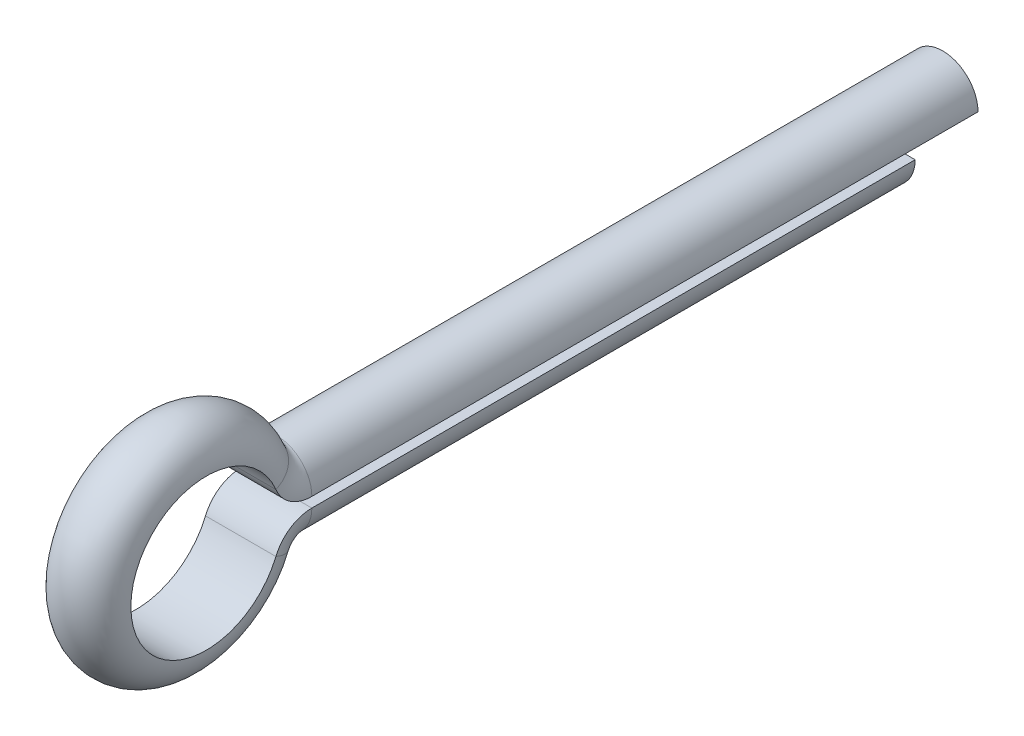
ISO-10303-21;
HEADER;
FILE_DESCRIPTION(('STEP AP214'),'2;1');
FILE_NAME('part.step','',(''),(''),'','','');
FILE_SCHEMA(('AUTOMOTIVE_DESIGN { 1 0 10303 214 1 1 1 1 }'));
ENDSEC;
DATA;
#1=APPLICATION_CONTEXT('core data for automotive mechanical design processes');
#2=APPLICATION_PROTOCOL_DEFINITION('international standard','automotive_design',2000,#1);
#3=PRODUCT_CONTEXT('',#1,'mechanical');
#4=PRODUCT('Part','Part','',(#3));
#5=PRODUCT_RELATED_PRODUCT_CATEGORY('part','',(#4));
#6=PRODUCT_DEFINITION_FORMATION('','',#4);
#7=PRODUCT_DEFINITION_CONTEXT('part definition',#1,'design');
#8=PRODUCT_DEFINITION('design','',#6,#7);
#9=PRODUCT_DEFINITION_SHAPE('','',#8);
#10=(LENGTH_UNIT() NAMED_UNIT(*) SI_UNIT(.MILLI.,.METRE.));
#11=(NAMED_UNIT(*) PLANE_ANGLE_UNIT() SI_UNIT($,.RADIAN.));
#12=(NAMED_UNIT(*) SI_UNIT($,.STERADIAN.) SOLID_ANGLE_UNIT());
#13=UNCERTAINTY_MEASURE_WITH_UNIT(LENGTH_MEASURE(1.E-05),#10,'distance_accuracy_value','');
#14=(GEOMETRIC_REPRESENTATION_CONTEXT(3) GLOBAL_UNCERTAINTY_ASSIGNED_CONTEXT((#13)) GLOBAL_UNIT_ASSIGNED_CONTEXT((#10,
#11,#12)) REPRESENTATION_CONTEXT('',''));
#15=CARTESIAN_POINT('',(0.,0.,0.));
#16=DIRECTION('',(0.,0.,1.));
#17=DIRECTION('',(1.,0.,0.));
#18=AXIS2_PLACEMENT_3D('',#15,#16,#17);
#19=CARTESIAN_POINT('',(0.,-0.1,0.));
#20=DIRECTION('',(0.,0.,1.));
#21=DIRECTION('',(1.,0.,0.));
#22=AXIS2_PLACEMENT_3D('',#19,#20,#21);
#23=PLANE('',#22);
#24=CARTESIAN_POINT('',(0.,-0.1,0.));
#25=DIRECTION('',(0.,0.,1.));
#26=DIRECTION('',(1.,0.,0.));
#27=AXIS2_PLACEMENT_3D('',#24,#25,#26);
#28=CIRCLE('',#27,0.7);
#29=CARTESIAN_POINT('',(-0.7,-0.1,0.));
#30=VERTEX_POINT('',#29);
#31=CARTESIAN_POINT('',(0.7,-0.1,0.));
#32=VERTEX_POINT('',#31);
#33=EDGE_CURVE('E46',#30,#32,#28,.T.);
#34=ORIENTED_EDGE('',*,*,#33,.F.);
#35=DIRECTION('',(-1.,0.,0.));
#36=VECTOR('',#35,1.);
#37=CARTESIAN_POINT('',(-0.7,-0.1,0.));
#38=LINE('',#37,#36);
#39=EDGE_CURVE('E11',#32,#30,#38,.T.);
#40=ORIENTED_EDGE('',*,*,#39,.F.);
#41=EDGE_LOOP('',(#34,#40));
#42=FACE_BOUND('',#41,.T.);
#43=ADVANCED_FACE('F32',(#42),#23,.F.);
#44=CARTESIAN_POINT('',(0.,0.,14.1));
#45=DIRECTION('',(1.,0.,0.));
#46=DIRECTION('',(0.,0.,-1.));
#47=AXIS2_PLACEMENT_3D('',#44,#45,#46);
#48=TOROIDAL_SURFACE('',#47,1.5,0.7);
#49=CARTESIAN_POINT('',(0.7,0.,14.1));
#50=DIRECTION('',(1.,0.,0.));
#51=DIRECTION('',(0.,0.,1.));
#52=AXIS2_PLACEMENT_3D('',#49,#50,#51);
#53=CIRCLE('',#52,1.5);
#54=CARTESIAN_POINT('',(0.7,0.576923076923077,12.7153846153846));
#55=VERTEX_POINT('',#54);
#56=CARTESIAN_POINT('',(0.7,-0.576923076923077,12.7153846153846));
#57=VERTEX_POINT('',#56);
#58=EDGE_CURVE('E122',#55,#57,#53,.T.);
#59=ORIENTED_EDGE('',*,*,#58,.F.);
#60=CARTESIAN_POINT('',(0.,0.576923076923078,12.7153846153846));
#61=DIRECTION('',(0.,-0.923076923076923,-0.384615384615384));
#62=DIRECTION('',(1.,0.,0.));
#63=AXIS2_PLACEMENT_3D('',#60,#61,#62);
#64=CIRCLE('',#63,0.7);
#65=CARTESIAN_POINT('',(-0.7,0.576923076923077,12.7153846153846));
#66=VERTEX_POINT('',#65);
#67=EDGE_CURVE('E100',#55,#66,#64,.F.);
#68=ORIENTED_EDGE('',*,*,#67,.T.);
#69=CARTESIAN_POINT('',(-0.7,0.,14.1));
#70=DIRECTION('',(1.,0.,0.));
#71=DIRECTION('',(0.,0.,1.));
#72=AXIS2_PLACEMENT_3D('',#69,#70,#71);
#73=CIRCLE('',#72,1.5);
#74=CARTESIAN_POINT('',(-0.7,-0.576923076923077,12.7153846153846));
#75=VERTEX_POINT('',#74);
#76=EDGE_CURVE('E114',#66,#75,#73,.T.);
#77=ORIENTED_EDGE('',*,*,#76,.T.);
#78=CARTESIAN_POINT('',(0.,-0.576923076923078,12.7153846153846));
#79=DIRECTION('',(0.,-0.923076923076923,0.384615384615384));
#80=DIRECTION('',(1.,0.,0.));
#81=AXIS2_PLACEMENT_3D('',#78,#79,#80);
#82=CIRCLE('',#81,0.7);
#83=EDGE_CURVE('E119',#75,#57,#82,.T.);
#84=ORIENTED_EDGE('',*,*,#83,.T.);
#85=EDGE_LOOP('',(#59,#68,#77,#84));
#86=FACE_BOUND('',#85,.T.);
#87=ADVANCED_FACE('F154',(#86),#48,.T.);
#88=CARTESIAN_POINT('',(0.,0.,14.1));
#89=DIRECTION('',(1.,0.,0.));
#90=DIRECTION('',(0.,0.,-1.));
#91=AXIS2_PLACEMENT_3D('',#88,#89,#90);
#92=CYLINDRICAL_SURFACE('',#91,1.5);
#93=DIRECTION('',(-1.,0.,0.));
#94=VECTOR('',#93,1.);
#95=CARTESIAN_POINT('',(-0.7,-0.576923076923078,12.7153846153846));
#96=LINE('',#95,#94);
#97=EDGE_CURVE('E125',#57,#75,#96,.T.);
#98=ORIENTED_EDGE('',*,*,#97,.T.);
#99=ORIENTED_EDGE('',*,*,#76,.F.);
#100=DIRECTION('',(-1.,0.,0.));
#101=VECTOR('',#100,1.);
#102=CARTESIAN_POINT('',(-0.7,0.576923076923078,12.7153846153846));
#103=LINE('',#102,#101);
#104=EDGE_CURVE('E107',#66,#55,#103,.F.);
#105=ORIENTED_EDGE('',*,*,#104,.T.);
#106=ORIENTED_EDGE('',*,*,#58,.T.);
#107=EDGE_LOOP('',(#98,#99,#105,#106));
#108=FACE_BOUND('',#107,.T.);
#109=ADVANCED_FACE('F158',(#108),#92,.F.);
#110=CARTESIAN_POINT('',(0.,-0.875,12.));
#111=DIRECTION('',(-1.,0.,0.));
#112=DIRECTION('',(0.,0.,1.));
#113=AXIS2_PLACEMENT_3D('',#110,#111,#112);
#114=TOROIDAL_SURFACE('',#113,0.775,0.7);
#115=CARTESIAN_POINT('',(0.7,-0.875,12.));
#116=DIRECTION('',(-1.,0.,0.));
#117=DIRECTION('',(0.,0.384615384615383,0.923076923076924));
#118=AXIS2_PLACEMENT_3D('',#115,#116,#117);
#119=CIRCLE('',#118,0.775);
#120=CARTESIAN_POINT('',(0.7,-0.1,12.));
#121=VERTEX_POINT('',#120);
#122=EDGE_CURVE('E131',#57,#121,#119,.T.);
#123=ORIENTED_EDGE('',*,*,#122,.F.);
#124=ORIENTED_EDGE('',*,*,#83,.F.);
#125=CARTESIAN_POINT('',(-0.7,-0.875,12.));
#126=DIRECTION('',(-1.,0.,0.));
#127=DIRECTION('',(0.,0.384615384615383,0.923076923076924));
#128=AXIS2_PLACEMENT_3D('',#125,#126,#127);
#129=CIRCLE('',#128,0.775);
#130=CARTESIAN_POINT('',(-0.7,-0.1,12.));
#131=VERTEX_POINT('',#130);
#132=EDGE_CURVE('E132',#75,#131,#129,.T.);
#133=ORIENTED_EDGE('',*,*,#132,.T.);
#134=CARTESIAN_POINT('',(0.,-0.100000000000001,12.));
#135=DIRECTION('',(0.,0.,1.));
#136=DIRECTION('',(1.,0.,0.));
#137=AXIS2_PLACEMENT_3D('',#134,#135,#136);
#138=CIRCLE('',#137,0.7);
#139=EDGE_CURVE('E128',#131,#121,#138,.T.);
#140=ORIENTED_EDGE('',*,*,#139,.T.);
#141=EDGE_LOOP('',(#123,#124,#133,#140));
#142=FACE_BOUND('',#141,.T.);
#143=ADVANCED_FACE('F152',(#142),#114,.T.);
#144=CARTESIAN_POINT('',(0.,-0.875,12.));
#145=DIRECTION('',(-1.,0.,0.));
#146=DIRECTION('',(0.,0.,1.));
#147=AXIS2_PLACEMENT_3D('',#144,#145,#146);
#148=CYLINDRICAL_SURFACE('',#147,0.775);
#149=DIRECTION('',(-1.,0.,0.));
#150=VECTOR('',#149,1.);
#151=CARTESIAN_POINT('',(-0.7,-0.100000000000001,12.));
#152=LINE('',#151,#150);
#153=EDGE_CURVE('E135',#121,#131,#152,.T.);
#154=ORIENTED_EDGE('',*,*,#153,.T.);
#155=ORIENTED_EDGE('',*,*,#132,.F.);
#156=ORIENTED_EDGE('',*,*,#97,.F.);
#157=ORIENTED_EDGE('',*,*,#122,.T.);
#158=EDGE_LOOP('',(#154,#155,#156,#157));
#159=FACE_BOUND('',#158,.T.);
#160=ADVANCED_FACE('F147',(#159),#148,.T.);
#161=CARTESIAN_POINT('',(0.,-0.100000000000002,12.));
#162=DIRECTION('',(0.,0.,-1.));
#163=DIRECTION('',(0.,1.,0.));
#164=AXIS2_PLACEMENT_3D('',#161,#162,#163);
#165=CYLINDRICAL_SURFACE('',#164,0.7);
#166=DIRECTION('',(0.,0.,-1.));
#167=VECTOR('',#166,1.);
#168=CARTESIAN_POINT('',(0.7,-0.100000000000001,12.));
#169=LINE('',#168,#167);
#170=EDGE_CURVE('E39',#121,#32,#169,.T.);
#171=ORIENTED_EDGE('',*,*,#170,.F.);
#172=ORIENTED_EDGE('',*,*,#139,.F.);
#173=DIRECTION('',(0.,0.,-1.));
#174=VECTOR('',#173,1.);
#175=CARTESIAN_POINT('',(-0.7,-0.100000000000001,12.));
#176=LINE('',#175,#174);
#177=EDGE_CURVE('E139',#131,#30,#176,.T.);
#178=ORIENTED_EDGE('',*,*,#177,.T.);
#179=ORIENTED_EDGE('',*,*,#33,.T.);
#180=EDGE_LOOP('',(#171,#172,#178,#179));
#181=FACE_BOUND('',#180,.T.);
#182=ADVANCED_FACE('F149',(#181),#165,.T.);
#183=CARTESIAN_POINT('',(-0.7,-0.100000000000001,12.));
#184=DIRECTION('',(0.,-1.,0.));
#185=DIRECTION('',(0.,0.,-1.));
#186=AXIS2_PLACEMENT_3D('',#183,#184,#185);
#187=PLANE('',#186);
#188=ORIENTED_EDGE('',*,*,#39,.T.);
#189=ORIENTED_EDGE('',*,*,#177,.F.);
#190=ORIENTED_EDGE('',*,*,#153,.F.);
#191=ORIENTED_EDGE('',*,*,#170,.T.);
#192=EDGE_LOOP('',(#188,#189,#190,#191));
#193=FACE_BOUND('',#192,.T.);
#194=ADVANCED_FACE('F172',(#193),#187,.F.);
#195=CARTESIAN_POINT('',(0.,0.875,12.));
#196=DIRECTION('',(1.,0.,0.));
#197=DIRECTION('',(0.,0.,-1.));
#198=AXIS2_PLACEMENT_3D('',#195,#196,#197);
#199=TOROIDAL_SURFACE('',#198,0.775,0.7);
#200=CARTESIAN_POINT('',(-0.7,0.875,12.));
#201=DIRECTION('',(1.,0.,0.));
#202=DIRECTION('',(0.,-0.384615384615383,0.923076923076924));
#203=AXIS2_PLACEMENT_3D('',#200,#201,#202);
#204=CIRCLE('',#203,0.775);
#205=CARTESIAN_POINT('',(-0.7,0.1,12.));
#206=VERTEX_POINT('',#205);
#207=EDGE_CURVE('E109',#66,#206,#204,.T.);
#208=ORIENTED_EDGE('',*,*,#207,.F.);
#209=ORIENTED_EDGE('',*,*,#67,.F.);
#210=CARTESIAN_POINT('',(0.7,0.875,12.));
#211=DIRECTION('',(1.,0.,0.));
#212=DIRECTION('',(0.,-0.384615384615383,0.923076923076924));
#213=AXIS2_PLACEMENT_3D('',#210,#211,#212);
#214=CIRCLE('',#213,0.775);
#215=CARTESIAN_POINT('',(0.7,0.1,12.));
#216=VERTEX_POINT('',#215);
#217=EDGE_CURVE('E110',#55,#216,#214,.T.);
#218=ORIENTED_EDGE('',*,*,#217,.T.);
#219=CARTESIAN_POINT('',(0.,0.100000000000001,12.));
#220=DIRECTION('',(0.,0.,-1.));
#221=DIRECTION('',(1.,0.,0.));
#222=AXIS2_PLACEMENT_3D('',#219,#220,#221);
#223=CIRCLE('',#222,0.7);
#224=EDGE_CURVE('E88',#216,#206,#223,.F.);
#225=ORIENTED_EDGE('',*,*,#224,.T.);
#226=EDGE_LOOP('',(#208,#209,#218,#225));
#227=FACE_BOUND('',#226,.T.);
#228=ADVANCED_FACE('F161',(#227),#199,.T.);
#229=CARTESIAN_POINT('',(0.,0.875,12.));
#230=DIRECTION('',(1.,0.,0.));
#231=DIRECTION('',(0.,0.,-1.));
#232=AXIS2_PLACEMENT_3D('',#229,#230,#231);
#233=CYLINDRICAL_SURFACE('',#232,0.775);
#234=DIRECTION('',(-1.,0.,0.));
#235=VECTOR('',#234,1.);
#236=CARTESIAN_POINT('',(-0.7,0.100000000000001,12.));
#237=LINE('',#236,#235);
#238=EDGE_CURVE('E94',#206,#216,#237,.F.);
#239=ORIENTED_EDGE('',*,*,#238,.T.);
#240=ORIENTED_EDGE('',*,*,#217,.F.);
#241=ORIENTED_EDGE('',*,*,#104,.F.);
#242=ORIENTED_EDGE('',*,*,#207,.T.);
#243=EDGE_LOOP('',(#239,#240,#241,#242));
#244=FACE_BOUND('',#243,.T.);
#245=ADVANCED_FACE('F164',(#244),#233,.T.);
#246=CARTESIAN_POINT('',(0.,0.100000000000002,12.));
#247=DIRECTION('',(0.,0.,-1.));
#248=DIRECTION('',(0.,1.,0.));
#249=AXIS2_PLACEMENT_3D('',#246,#247,#248);
#250=CYLINDRICAL_SURFACE('',#249,0.7);
#251=DIRECTION('',(0.,0.,-1.));
#252=VECTOR('',#251,1.);
#253=CARTESIAN_POINT('',(-0.7,0.100000000000001,12.));
#254=LINE('',#253,#252);
#255=CARTESIAN_POINT('',(-0.7,0.1,-1.25));
#256=VERTEX_POINT('',#255);
#257=EDGE_CURVE('E93',#206,#256,#254,.T.);
#258=ORIENTED_EDGE('',*,*,#257,.F.);
#259=ORIENTED_EDGE('',*,*,#224,.F.);
#260=DIRECTION('',(0.,0.,-1.));
#261=VECTOR('',#260,1.);
#262=CARTESIAN_POINT('',(0.7,0.100000000000001,12.));
#263=LINE('',#262,#261);
#264=CARTESIAN_POINT('',(0.7,0.1,-1.25));
#265=VERTEX_POINT('',#264);
#266=EDGE_CURVE('E82',#216,#265,#263,.T.);
#267=ORIENTED_EDGE('',*,*,#266,.T.);
#268=CARTESIAN_POINT('',(0.,0.1,-1.25));
#269=DIRECTION('',(0.,0.,-1.));
#270=DIRECTION('',(-1.,0.,0.));
#271=AXIS2_PLACEMENT_3D('',#268,#269,#270);
#272=CIRCLE('',#271,0.7);
#273=EDGE_CURVE('E86',#256,#265,#272,.T.);
#274=ORIENTED_EDGE('',*,*,#273,.F.);
#275=EDGE_LOOP('',(#258,#259,#267,#274));
#276=FACE_BOUND('',#275,.T.);
#277=ADVANCED_FACE('F84',(#276),#250,.T.);
#278=CARTESIAN_POINT('',(-0.7,0.100000000000001,12.));
#279=DIRECTION('',(0.,1.,0.));
#280=DIRECTION('',(0.,0.,1.));
#281=AXIS2_PLACEMENT_3D('',#278,#279,#280);
#282=PLANE('',#281);
#283=ORIENTED_EDGE('',*,*,#257,.T.);
#284=DIRECTION('',(-1.,0.,0.));
#285=VECTOR('',#284,1.);
#286=CARTESIAN_POINT('',(-0.7,0.1,-1.25));
#287=LINE('',#286,#285);
#288=EDGE_CURVE('E97',#265,#256,#287,.T.);
#289=ORIENTED_EDGE('',*,*,#288,.F.);
#290=ORIENTED_EDGE('',*,*,#266,.F.);
#291=ORIENTED_EDGE('',*,*,#238,.F.);
#292=EDGE_LOOP('',(#283,#289,#290,#291));
#293=FACE_BOUND('',#292,.T.);
#294=ADVANCED_FACE('F98',(#293),#282,.F.);
#295=CARTESIAN_POINT('',(0.,0.1,-1.25));
#296=DIRECTION('',(0.,0.,-1.));
#297=DIRECTION('',(-1.,0.,0.));
#298=AXIS2_PLACEMENT_3D('',#295,#296,#297);
#299=PLANE('',#298);
#300=ORIENTED_EDGE('',*,*,#273,.T.);
#301=ORIENTED_EDGE('',*,*,#288,.T.);
#302=EDGE_LOOP('',(#300,#301));
#303=FACE_BOUND('',#302,.T.);
#304=ADVANCED_FACE('F102',(#303),#299,.T.);
#305=CLOSED_SHELL('',(#43,#87,#109,#143,#160,#182,#194,#228,#245,#277,#294,#304));
#306=MANIFOLD_SOLID_BREP('B2',#305);
#307=ADVANCED_BREP_SHAPE_REPRESENTATION('',(#18,#306),#14);
#308=SHAPE_DEFINITION_REPRESENTATION(#9,#307);
ENDSEC;
END-ISO-10303-21;
